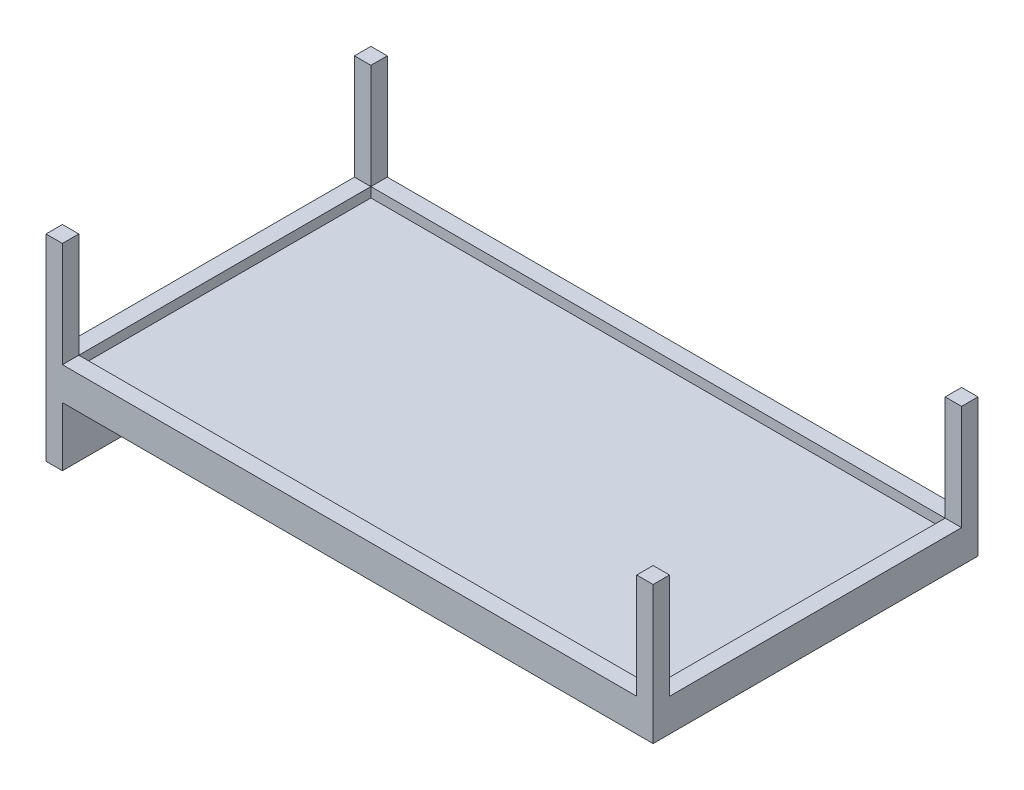
ISO-10303-21;
HEADER;
FILE_DESCRIPTION(('STEP AP214'),'2;1');
FILE_NAME('part.step','',(''),(''),'','','');
FILE_SCHEMA(('AUTOMOTIVE_DESIGN { 1 0 10303 214 1 1 1 1 }'));
ENDSEC;
DATA;
#1=APPLICATION_CONTEXT('core data for automotive mechanical design processes');
#2=APPLICATION_PROTOCOL_DEFINITION('international standard','automotive_design',2000,#1);
#3=PRODUCT_CONTEXT('',#1,'mechanical');
#4=PRODUCT('Part','Part','',(#3));
#5=PRODUCT_RELATED_PRODUCT_CATEGORY('part','',(#4));
#6=PRODUCT_DEFINITION_FORMATION('','',#4);
#7=PRODUCT_DEFINITION_CONTEXT('part definition',#1,'design');
#8=PRODUCT_DEFINITION('design','',#6,#7);
#9=PRODUCT_DEFINITION_SHAPE('','',#8);
#10=(LENGTH_UNIT() NAMED_UNIT(*) SI_UNIT(.MILLI.,.METRE.));
#11=(NAMED_UNIT(*) PLANE_ANGLE_UNIT() SI_UNIT($,.RADIAN.));
#12=(NAMED_UNIT(*) SI_UNIT($,.STERADIAN.) SOLID_ANGLE_UNIT());
#13=UNCERTAINTY_MEASURE_WITH_UNIT(LENGTH_MEASURE(1.E-05),#10,'distance_accuracy_value','');
#14=(GEOMETRIC_REPRESENTATION_CONTEXT(3) GLOBAL_UNCERTAINTY_ASSIGNED_CONTEXT((#13)) GLOBAL_UNIT_ASSIGNED_CONTEXT((#10,
#11,#12)) REPRESENTATION_CONTEXT('',''));
#15=CARTESIAN_POINT('',(0.,0.,0.));
#16=DIRECTION('',(0.,0.,1.));
#17=DIRECTION('',(1.,0.,0.));
#18=AXIS2_PLACEMENT_3D('',#15,#16,#17);
#19=CARTESIAN_POINT('',(0.,8.,0.));
#20=DIRECTION('',(0.,1.,0.));
#21=DIRECTION('',(0.,0.,1.));
#22=AXIS2_PLACEMENT_3D('',#19,#20,#21);
#23=PLANE('',#22);
#24=DIRECTION('',(1.,0.,0.));
#25=VECTOR('',#24,1.);
#26=CARTESIAN_POINT('',(0.,8.,39.0908590308371));
#27=LINE('',#26,#25);
#28=CARTESIAN_POINT('',(-77.8847688979616,8.,39.0908590308371));
#29=VERTEX_POINT('',#28);
#30=CARTESIAN_POINT('',(97.1152311020383,8.,39.0908590308371));
#31=VERTEX_POINT('',#30);
#32=EDGE_CURVE('E430',#29,#31,#27,.T.);
#33=ORIENTED_EDGE('',*,*,#32,.F.);
#34=DIRECTION('',(0.,0.,1.));
#35=VECTOR('',#34,1.);
#36=CARTESIAN_POINT('',(-77.8847688979616,8.,0.));
#37=LINE('',#36,#35);
#38=CARTESIAN_POINT('',(-77.8847688979616,8.,44.0908590308371));
#39=VERTEX_POINT('',#38);
#40=EDGE_CURVE('E249',#29,#39,#37,.T.);
#41=ORIENTED_EDGE('',*,*,#40,.T.);
#42=DIRECTION('',(1.,0.,0.));
#43=VECTOR('',#42,1.);
#44=CARTESIAN_POINT('',(0.,8.,44.0908590308371));
#45=LINE('',#44,#43);
#46=CARTESIAN_POINT('',(97.1152311020383,8.,44.0908590308371));
#47=VERTEX_POINT('',#46);
#48=EDGE_CURVE('E55',#39,#47,#45,.T.);
#49=ORIENTED_EDGE('',*,*,#48,.T.);
#50=DIRECTION('',(0.,0.,-1.));
#51=VECTOR('',#50,1.);
#52=CARTESIAN_POINT('',(97.1152311020383,8.,0.));
#53=LINE('',#52,#51);
#54=EDGE_CURVE('E280',#47,#31,#53,.T.);
#55=ORIENTED_EDGE('',*,*,#54,.T.);
#56=EDGE_LOOP('',(#33,#41,#49,#55));
#57=FACE_BOUND('',#56,.T.);
#58=ADVANCED_FACE('F39',(#57),#23,.T.);
#59=DIRECTION('',(0.,0.,1.));
#60=VECTOR('',#59,1.);
#61=CARTESIAN_POINT('',(-82.8847688979616,8.,0.));
#62=LINE('',#61,#60);
#63=CARTESIAN_POINT('',(-82.8847688979616,8.,-49.9091409691629));
#64=VERTEX_POINT('',#63);
#65=CARTESIAN_POINT('',(-82.8847688979616,8.,39.0908590308371));
#66=VERTEX_POINT('',#65);
#67=EDGE_CURVE('E406',#64,#66,#62,.T.);
#68=ORIENTED_EDGE('',*,*,#67,.T.);
#69=DIRECTION('',(1.,0.,0.));
#70=VECTOR('',#69,1.);
#71=CARTESIAN_POINT('',(0.,8.,39.0908590308371));
#72=LINE('',#71,#70);
#73=EDGE_CURVE('E245',#66,#29,#72,.T.);
#74=ORIENTED_EDGE('',*,*,#73,.T.);
#75=DIRECTION('',(0.,0.,1.));
#76=VECTOR('',#75,1.);
#77=CARTESIAN_POINT('',(-77.8847688979617,8.,0.));
#78=LINE('',#77,#76);
#79=CARTESIAN_POINT('',(-77.8847688979617,8.,-49.9091409691629));
#80=VERTEX_POINT('',#79);
#81=EDGE_CURVE('E434',#80,#29,#78,.T.);
#82=ORIENTED_EDGE('',*,*,#81,.F.);
#83=DIRECTION('',(-1.,0.,0.));
#84=VECTOR('',#83,1.);
#85=CARTESIAN_POINT('',(0.,8.,-49.9091409691629));
#86=LINE('',#85,#84);
#87=EDGE_CURVE('E11',#80,#64,#86,.T.);
#88=ORIENTED_EDGE('',*,*,#87,.T.);
#89=EDGE_LOOP('',(#68,#74,#82,#88));
#90=FACE_BOUND('',#89,.T.);
#91=ADVANCED_FACE('F500',(#90),#23,.T.);
#92=DIRECTION('',(0.,0.,1.));
#93=VECTOR('',#92,1.);
#94=CARTESIAN_POINT('',(97.1152311020383,8.,0.));
#95=LINE('',#94,#93);
#96=CARTESIAN_POINT('',(97.1152311020383,8.,-49.9091409691629));
#97=VERTEX_POINT('',#96);
#98=EDGE_CURVE('E442',#97,#31,#95,.T.);
#99=ORIENTED_EDGE('',*,*,#98,.T.);
#100=DIRECTION('',(1.,0.,0.));
#101=VECTOR('',#100,1.);
#102=CARTESIAN_POINT('',(0.,8.,39.0908590308371));
#103=LINE('',#102,#101);
#104=CARTESIAN_POINT('',(102.115231102038,8.,39.0908590308371));
#105=VERTEX_POINT('',#104);
#106=EDGE_CURVE('E63',#31,#105,#103,.T.);
#107=ORIENTED_EDGE('',*,*,#106,.T.);
#108=DIRECTION('',(0.,0.,1.));
#109=VECTOR('',#108,1.);
#110=CARTESIAN_POINT('',(102.115231102038,8.,0.));
#111=LINE('',#110,#109);
#112=CARTESIAN_POINT('',(102.115231102038,8.,-49.9091409691629));
#113=VERTEX_POINT('',#112);
#114=EDGE_CURVE('E423',#113,#105,#111,.T.);
#115=ORIENTED_EDGE('',*,*,#114,.F.);
#116=DIRECTION('',(-1.,0.,0.));
#117=VECTOR('',#116,1.);
#118=CARTESIAN_POINT('',(0.,8.,-49.9091409691629));
#119=LINE('',#118,#117);
#120=EDGE_CURVE('E308',#113,#97,#119,.T.);
#121=ORIENTED_EDGE('',*,*,#120,.T.);
#122=EDGE_LOOP('',(#99,#107,#115,#121));
#123=FACE_BOUND('',#122,.T.);
#124=ADVANCED_FACE('F513',(#123),#23,.T.);
#125=DIRECTION('',(1.,0.,0.));
#126=VECTOR('',#125,1.);
#127=CARTESIAN_POINT('',(0.,8.,-49.9091409691629));
#128=LINE('',#127,#126);
#129=EDGE_CURVE('E438',#80,#97,#128,.T.);
#130=ORIENTED_EDGE('',*,*,#129,.T.);
#131=DIRECTION('',(0.,0.,-1.));
#132=VECTOR('',#131,1.);
#133=CARTESIAN_POINT('',(97.1152311020383,8.,0.));
#134=LINE('',#133,#132);
#135=CARTESIAN_POINT('',(97.1152311020383,8.,-54.9091409691629));
#136=VERTEX_POINT('',#135);
#137=EDGE_CURVE('E312',#97,#136,#134,.T.);
#138=ORIENTED_EDGE('',*,*,#137,.T.);
#139=DIRECTION('',(1.,0.,0.));
#140=VECTOR('',#139,1.);
#141=CARTESIAN_POINT('',(0.,8.,-54.9091409691629));
#142=LINE('',#141,#140);
#143=CARTESIAN_POINT('',(-77.8847688979617,8.,-54.9091409691629));
#144=VERTEX_POINT('',#143);
#145=EDGE_CURVE('E426',#144,#136,#142,.T.);
#146=ORIENTED_EDGE('',*,*,#145,.F.);
#147=DIRECTION('',(0.,0.,1.));
#148=VECTOR('',#147,1.);
#149=CARTESIAN_POINT('',(-77.8847688979617,8.,0.));
#150=LINE('',#149,#148);
#151=EDGE_CURVE('E48',#144,#80,#150,.T.);
#152=ORIENTED_EDGE('',*,*,#151,.T.);
#153=EDGE_LOOP('',(#130,#138,#146,#152));
#154=FACE_BOUND('',#153,.T.);
#155=ADVANCED_FACE('F487',(#154),#23,.T.);
#156=CARTESIAN_POINT('',(-82.8847688979616,5.,-54.9091409691629));
#157=DIRECTION('',(1.,0.,0.));
#158=DIRECTION('',(0.,0.,-1.));
#159=AXIS2_PLACEMENT_3D('',#156,#157,#158);
#160=PLANE('',#159);
#161=DIRECTION('',(0.,-1.,0.));
#162=VECTOR('',#161,1.);
#163=CARTESIAN_POINT('',(-82.8847688979616,5.,44.0908590308371));
#164=LINE('',#163,#162);
#165=CARTESIAN_POINT('',(-82.8847688979616,40.,44.0908590308371));
#166=VERTEX_POINT('',#165);
#167=CARTESIAN_POINT('',(-82.8847688979616,-20.,44.0908590308371));
#168=VERTEX_POINT('',#167);
#169=EDGE_CURVE('E204',#166,#168,#164,.T.);
#170=ORIENTED_EDGE('',*,*,#169,.F.);
#171=DIRECTION('',(0.,0.,1.));
#172=VECTOR('',#171,1.);
#173=CARTESIAN_POINT('',(-82.8847688979616,40.,44.0908590308371));
#174=LINE('',#173,#172);
#175=CARTESIAN_POINT('',(-82.8847688979616,40.,39.0908590308371));
#176=VERTEX_POINT('',#175);
#177=EDGE_CURVE('E208',#176,#166,#174,.T.);
#178=ORIENTED_EDGE('',*,*,#177,.F.);
#179=DIRECTION('',(0.,-1.,0.));
#180=VECTOR('',#179,1.);
#181=CARTESIAN_POINT('',(-82.8847688979616,40.,39.0908590308371));
#182=LINE('',#181,#180);
#183=EDGE_CURVE('E237',#176,#66,#182,.T.);
#184=ORIENTED_EDGE('',*,*,#183,.T.);
#185=ORIENTED_EDGE('',*,*,#67,.F.);
#186=DIRECTION('',(0.,-1.,0.));
#187=VECTOR('',#186,1.);
#188=CARTESIAN_POINT('',(-82.8847688979616,40.,-49.9091409691629));
#189=LINE('',#188,#187);
#190=CARTESIAN_POINT('',(-82.8847688979616,40.,-49.9091409691629));
#191=VERTEX_POINT('',#190);
#192=EDGE_CURVE('E337',#191,#64,#189,.T.);
#193=ORIENTED_EDGE('',*,*,#192,.F.);
#194=DIRECTION('',(0.,0.,1.));
#195=VECTOR('',#194,1.);
#196=CARTESIAN_POINT('',(-82.8847688979616,40.,-54.9091409691629));
#197=LINE('',#196,#195);
#198=CARTESIAN_POINT('',(-82.8847688979616,40.,-54.9091409691629));
#199=VERTEX_POINT('',#198);
#200=EDGE_CURVE('E316',#199,#191,#197,.T.);
#201=ORIENTED_EDGE('',*,*,#200,.F.);
#202=DIRECTION('',(0.,-1.,0.));
#203=VECTOR('',#202,1.);
#204=CARTESIAN_POINT('',(-82.8847688979616,5.,-54.9091409691629));
#205=LINE('',#204,#203);
#206=CARTESIAN_POINT('',(-82.8847688979616,-20.,-54.9091409691629));
#207=VERTEX_POINT('',#206);
#208=EDGE_CURVE('E474',#199,#207,#205,.T.);
#209=ORIENTED_EDGE('',*,*,#208,.T.);
#210=DIRECTION('',(0.,0.,1.));
#211=VECTOR('',#210,1.);
#212=CARTESIAN_POINT('',(-82.8847688979616,-20.,-54.9091409691629));
#213=LINE('',#212,#211);
#214=EDGE_CURVE('E210',#207,#168,#213,.T.);
#215=ORIENTED_EDGE('',*,*,#214,.T.);
#216=EDGE_LOOP('',(#170,#178,#184,#185,#193,#201,#209,#215));
#217=FACE_BOUND('',#216,.T.);
#218=ADVANCED_FACE('F41',(#217),#160,.F.);
#219=CARTESIAN_POINT('',(-82.8847688979616,5.,44.0908590308371));
#220=DIRECTION('',(0.,0.,-1.));
#221=DIRECTION('',(-1.,0.,0.));
#222=AXIS2_PLACEMENT_3D('',#219,#220,#221);
#223=PLANE('',#222);
#224=ORIENTED_EDGE('',*,*,#48,.F.);
#225=DIRECTION('',(0.,-1.,0.));
#226=VECTOR('',#225,1.);
#227=CARTESIAN_POINT('',(-77.8847688979616,40.,44.0908590308371));
#228=LINE('',#227,#226);
#229=CARTESIAN_POINT('',(-77.8847688979616,40.,44.0908590308371));
#230=VERTEX_POINT('',#229);
#231=EDGE_CURVE('E220',#230,#39,#228,.T.);
#232=ORIENTED_EDGE('',*,*,#231,.F.);
#233=DIRECTION('',(1.,0.,0.));
#234=VECTOR('',#233,1.);
#235=CARTESIAN_POINT('',(-82.8847688979616,40.,44.0908590308371));
#236=LINE('',#235,#234);
#237=EDGE_CURVE('E218',#166,#230,#236,.T.);
#238=ORIENTED_EDGE('',*,*,#237,.F.);
#239=ORIENTED_EDGE('',*,*,#169,.T.);
#240=DIRECTION('',(1.,0.,0.));
#241=VECTOR('',#240,1.);
#242=CARTESIAN_POINT('',(-82.8847688979616,-20.,44.0908590308371));
#243=LINE('',#242,#241);
#244=CARTESIAN_POINT('',(-77.8847688979616,-20.,44.0908590308371));
#245=VERTEX_POINT('',#244);
#246=EDGE_CURVE('E342',#168,#245,#243,.T.);
#247=ORIENTED_EDGE('',*,*,#246,.T.);
#248=DIRECTION('',(0.,1.,0.));
#249=VECTOR('',#248,1.);
#250=CARTESIAN_POINT('',(-77.8847688979616,-20.,44.0908590308371));
#251=LINE('',#250,#249);
#252=CARTESIAN_POINT('',(-77.8847688979616,-2.,44.0908590308371));
#253=VERTEX_POINT('',#252);
#254=EDGE_CURVE('E353',#245,#253,#251,.T.);
#255=ORIENTED_EDGE('',*,*,#254,.T.);
#256=DIRECTION('',(1.,0.,0.));
#257=VECTOR('',#256,1.);
#258=CARTESIAN_POINT('',(0.,-2.,44.0908590308371));
#259=LINE('',#258,#257);
#260=CARTESIAN_POINT('',(102.115231102038,-2.,44.0908590308371));
#261=VERTEX_POINT('',#260);
#262=EDGE_CURVE('E380',#253,#261,#259,.T.);
#263=ORIENTED_EDGE('',*,*,#262,.T.);
#264=DIRECTION('',(0.,-1.,0.));
#265=VECTOR('',#264,1.);
#266=CARTESIAN_POINT('',(102.115231102038,5.,44.0908590308371));
#267=LINE('',#266,#265);
#268=CARTESIAN_POINT('',(102.115231102038,40.,44.0908590308371));
#269=VERTEX_POINT('',#268);
#270=EDGE_CURVE('E215',#269,#261,#267,.T.);
#271=ORIENTED_EDGE('',*,*,#270,.F.);
#272=DIRECTION('',(1.,0.,0.));
#273=VECTOR('',#272,1.);
#274=CARTESIAN_POINT('',(102.115231102038,40.,44.0908590308371));
#275=LINE('',#274,#273);
#276=CARTESIAN_POINT('',(97.1152311020383,40.,44.0908590308371));
#277=VERTEX_POINT('',#276);
#278=EDGE_CURVE('E262',#277,#269,#275,.T.);
#279=ORIENTED_EDGE('',*,*,#278,.F.);
#280=DIRECTION('',(0.,-1.,0.));
#281=VECTOR('',#280,1.);
#282=CARTESIAN_POINT('',(97.1152311020383,40.,44.0908590308371));
#283=LINE('',#282,#281);
#284=EDGE_CURVE('E266',#277,#47,#283,.T.);
#285=ORIENTED_EDGE('',*,*,#284,.T.);
#286=EDGE_LOOP('',(#224,#232,#238,#239,#247,#255,#263,#271,#279,#285));
#287=FACE_BOUND('',#286,.T.);
#288=ADVANCED_FACE('F219',(#287),#223,.F.);
#289=CARTESIAN_POINT('',(102.115231102038,5.,-54.9091409691629));
#290=DIRECTION('',(-1.,0.,0.));
#291=DIRECTION('',(0.,0.,1.));
#292=AXIS2_PLACEMENT_3D('',#289,#290,#291);
#293=PLANE('',#292);
#294=ORIENTED_EDGE('',*,*,#114,.T.);
#295=DIRECTION('',(0.,-1.,0.));
#296=VECTOR('',#295,1.);
#297=CARTESIAN_POINT('',(102.115231102038,40.,39.0908590308371));
#298=LINE('',#297,#296);
#299=CARTESIAN_POINT('',(102.115231102038,40.,39.0908590308371));
#300=VERTEX_POINT('',#299);
#301=EDGE_CURVE('E274',#300,#105,#298,.T.);
#302=ORIENTED_EDGE('',*,*,#301,.F.);
#303=DIRECTION('',(0.,0.,-1.));
#304=VECTOR('',#303,1.);
#305=CARTESIAN_POINT('',(102.115231102038,40.,44.0908590308371));
#306=LINE('',#305,#304);
#307=EDGE_CURVE('E252',#269,#300,#306,.T.);
#308=ORIENTED_EDGE('',*,*,#307,.F.);
#309=ORIENTED_EDGE('',*,*,#270,.T.);
#310=DIRECTION('',(0.,0.,1.));
#311=VECTOR('',#310,1.);
#312=CARTESIAN_POINT('',(102.115231102038,-2.,0.));
#313=LINE('',#312,#311);
#314=CARTESIAN_POINT('',(102.115231102038,-2.,-54.9091409691629));
#315=VERTEX_POINT('',#314);
#316=EDGE_CURVE('E384',#315,#261,#313,.T.);
#317=ORIENTED_EDGE('',*,*,#316,.F.);
#318=DIRECTION('',(0.,-1.,0.));
#319=VECTOR('',#318,1.);
#320=CARTESIAN_POINT('',(102.115231102038,5.,-54.9091409691629));
#321=LINE('',#320,#319);
#322=CARTESIAN_POINT('',(102.115231102038,40.,-54.9091409691629));
#323=VERTEX_POINT('',#322);
#324=EDGE_CURVE('E477',#323,#315,#321,.T.);
#325=ORIENTED_EDGE('',*,*,#324,.F.);
#326=DIRECTION('',(0.,0.,-1.));
#327=VECTOR('',#326,1.);
#328=CARTESIAN_POINT('',(102.115231102038,40.,-49.9091409691629));
#329=LINE('',#328,#327);
#330=CARTESIAN_POINT('',(102.115231102038,40.,-49.9091409691629));
#331=VERTEX_POINT('',#330);
#332=EDGE_CURVE('E290',#331,#323,#329,.T.);
#333=ORIENTED_EDGE('',*,*,#332,.F.);
#334=DIRECTION('',(0.,-1.,0.));
#335=VECTOR('',#334,1.);
#336=CARTESIAN_POINT('',(102.115231102038,40.,-49.9091409691629));
#337=LINE('',#336,#335);
#338=EDGE_CURVE('E300',#331,#113,#337,.T.);
#339=ORIENTED_EDGE('',*,*,#338,.T.);
#340=EDGE_LOOP('',(#294,#302,#308,#309,#317,#325,#333,#339));
#341=FACE_BOUND('',#340,.T.);
#342=ADVANCED_FACE('F658',(#341),#293,.F.);
#343=CARTESIAN_POINT('',(-82.8847688979616,5.,-54.9091409691629));
#344=DIRECTION('',(0.,0.,1.));
#345=DIRECTION('',(1.,0.,0.));
#346=AXIS2_PLACEMENT_3D('',#343,#344,#345);
#347=PLANE('',#346);
#348=ORIENTED_EDGE('',*,*,#145,.T.);
#349=DIRECTION('',(0.,-1.,0.));
#350=VECTOR('',#349,1.);
#351=CARTESIAN_POINT('',(97.1152311020383,40.,-54.9091409691629));
#352=LINE('',#351,#350);
#353=CARTESIAN_POINT('',(97.1152311020383,40.,-54.9091409691629));
#354=VERTEX_POINT('',#353);
#355=EDGE_CURVE('E297',#354,#136,#352,.T.);
#356=ORIENTED_EDGE('',*,*,#355,.F.);
#357=DIRECTION('',(-1.,0.,0.));
#358=VECTOR('',#357,1.);
#359=CARTESIAN_POINT('',(97.1152311020383,40.,-54.9091409691629));
#360=LINE('',#359,#358);
#361=EDGE_CURVE('E294',#323,#354,#360,.T.);
#362=ORIENTED_EDGE('',*,*,#361,.F.);
#363=ORIENTED_EDGE('',*,*,#324,.T.);
#364=DIRECTION('',(1.,0.,0.));
#365=VECTOR('',#364,1.);
#366=CARTESIAN_POINT('',(0.,-2.,-54.9091409691629));
#367=LINE('',#366,#365);
#368=CARTESIAN_POINT('',(-77.8847688979616,-2.,-54.9091409691629));
#369=VERTEX_POINT('',#368);
#370=EDGE_CURVE('E376',#369,#315,#367,.T.);
#371=ORIENTED_EDGE('',*,*,#370,.F.);
#372=DIRECTION('',(0.,1.,0.));
#373=VECTOR('',#372,1.);
#374=CARTESIAN_POINT('',(-77.8847688979616,-20.,-54.9091409691629));
#375=LINE('',#374,#373);
#376=CARTESIAN_POINT('',(-77.8847688979616,-20.,-54.9091409691629));
#377=VERTEX_POINT('',#376);
#378=EDGE_CURVE('E354',#377,#369,#375,.T.);
#379=ORIENTED_EDGE('',*,*,#378,.F.);
#380=DIRECTION('',(-1.,0.,0.));
#381=VECTOR('',#380,1.);
#382=CARTESIAN_POINT('',(-82.8847688979616,-20.,-54.9091409691629));
#383=LINE('',#382,#381);
#384=EDGE_CURVE('E349',#377,#207,#383,.T.);
#385=ORIENTED_EDGE('',*,*,#384,.T.);
#386=ORIENTED_EDGE('',*,*,#208,.F.);
#387=DIRECTION('',(-1.,0.,0.));
#388=VECTOR('',#387,1.);
#389=CARTESIAN_POINT('',(-82.8847688979616,40.,-54.9091409691629));
#390=LINE('',#389,#388);
#391=CARTESIAN_POINT('',(-77.8847688979617,40.,-54.9091409691629));
#392=VERTEX_POINT('',#391);
#393=EDGE_CURVE('E326',#392,#199,#390,.T.);
#394=ORIENTED_EDGE('',*,*,#393,.F.);
#395=DIRECTION('',(0.,-1.,0.));
#396=VECTOR('',#395,1.);
#397=CARTESIAN_POINT('',(-77.8847688979617,40.,-54.9091409691629));
#398=LINE('',#397,#396);
#399=EDGE_CURVE('E330',#392,#144,#398,.T.);
#400=ORIENTED_EDGE('',*,*,#399,.T.);
#401=EDGE_LOOP('',(#348,#356,#362,#363,#371,#379,#385,#386,#394,#400));
#402=FACE_BOUND('',#401,.T.);
#403=ADVANCED_FACE('F639',(#402),#347,.F.);
#404=CARTESIAN_POINT('',(0.,8.,39.0908590308371));
#405=DIRECTION('',(0.,0.,-1.));
#406=DIRECTION('',(-1.,0.,0.));
#407=AXIS2_PLACEMENT_3D('',#404,#405,#406);
#408=PLANE('',#407);
#409=DIRECTION('',(0.,-1.,0.));
#410=VECTOR('',#409,1.);
#411=CARTESIAN_POINT('',(97.1152311020383,8.,39.0908590308371));
#412=LINE('',#411,#410);
#413=CARTESIAN_POINT('',(97.1152311020383,5.,39.0908590308371));
#414=VERTEX_POINT('',#413);
#415=EDGE_CURVE('E445',#31,#414,#412,.T.);
#416=ORIENTED_EDGE('',*,*,#415,.T.);
#417=DIRECTION('',(-1.,0.,0.));
#418=VECTOR('',#417,1.);
#419=CARTESIAN_POINT('',(0.,5.,39.0908590308371));
#420=LINE('',#419,#418);
#421=CARTESIAN_POINT('',(-77.8847688979616,5.,39.0908590308371));
#422=VERTEX_POINT('',#421);
#423=EDGE_CURVE('E471',#414,#422,#420,.T.);
#424=ORIENTED_EDGE('',*,*,#423,.T.);
#425=DIRECTION('',(0.,-1.,0.));
#426=VECTOR('',#425,1.);
#427=CARTESIAN_POINT('',(-77.8847688979616,8.,39.0908590308371));
#428=LINE('',#427,#426);
#429=EDGE_CURVE('E456',#29,#422,#428,.T.);
#430=ORIENTED_EDGE('',*,*,#429,.F.);
#431=ORIENTED_EDGE('',*,*,#32,.T.);
#432=EDGE_LOOP('',(#416,#424,#430,#431));
#433=FACE_BOUND('',#432,.T.);
#434=ADVANCED_FACE('F506',(#433),#408,.T.);
#435=CARTESIAN_POINT('',(-77.8847688979617,8.,0.));
#436=DIRECTION('',(1.,0.,0.));
#437=DIRECTION('',(0.,0.,-1.));
#438=AXIS2_PLACEMENT_3D('',#435,#436,#437);
#439=PLANE('',#438);
#440=ORIENTED_EDGE('',*,*,#429,.T.);
#441=DIRECTION('',(0.,0.,-1.));
#442=VECTOR('',#441,1.);
#443=CARTESIAN_POINT('',(-77.8847688979617,5.,0.));
#444=LINE('',#443,#442);
#445=CARTESIAN_POINT('',(-77.8847688979617,5.,-49.9091409691629));
#446=VERTEX_POINT('',#445);
#447=EDGE_CURVE('E468',#422,#446,#444,.T.);
#448=ORIENTED_EDGE('',*,*,#447,.T.);
#449=DIRECTION('',(0.,-1.,0.));
#450=VECTOR('',#449,1.);
#451=CARTESIAN_POINT('',(-77.8847688979617,8.,-49.9091409691629));
#452=LINE('',#451,#450);
#453=EDGE_CURVE('E452',#80,#446,#452,.T.);
#454=ORIENTED_EDGE('',*,*,#453,.F.);
#455=ORIENTED_EDGE('',*,*,#81,.T.);
#456=EDGE_LOOP('',(#440,#448,#454,#455));
#457=FACE_BOUND('',#456,.T.);
#458=ADVANCED_FACE('F493',(#457),#439,.T.);
#459=CARTESIAN_POINT('',(0.,8.,-49.9091409691629));
#460=DIRECTION('',(0.,0.,-1.));
#461=DIRECTION('',(-1.,0.,0.));
#462=AXIS2_PLACEMENT_3D('',#459,#460,#461);
#463=PLANE('',#462);
#464=DIRECTION('',(-1.,0.,0.));
#465=VECTOR('',#464,1.);
#466=CARTESIAN_POINT('',(0.,5.,-49.9091409691629));
#467=LINE('',#466,#465);
#468=CARTESIAN_POINT('',(97.1152311020383,5.,-49.9091409691629));
#469=VERTEX_POINT('',#468);
#470=EDGE_CURVE('E464',#469,#446,#467,.T.);
#471=ORIENTED_EDGE('',*,*,#470,.F.);
#472=DIRECTION('',(0.,-1.,0.));
#473=VECTOR('',#472,1.);
#474=CARTESIAN_POINT('',(97.1152311020383,8.,-49.9091409691629));
#475=LINE('',#474,#473);
#476=EDGE_CURVE('E449',#97,#469,#475,.T.);
#477=ORIENTED_EDGE('',*,*,#476,.F.);
#478=ORIENTED_EDGE('',*,*,#129,.F.);
#479=ORIENTED_EDGE('',*,*,#453,.T.);
#480=EDGE_LOOP('',(#471,#477,#478,#479));
#481=FACE_BOUND('',#480,.T.);
#482=ADVANCED_FACE('F498',(#481),#463,.F.);
#483=CARTESIAN_POINT('',(97.1152311020383,8.,0.));
#484=DIRECTION('',(1.,0.,0.));
#485=DIRECTION('',(0.,0.,-1.));
#486=AXIS2_PLACEMENT_3D('',#483,#484,#485);
#487=PLANE('',#486);
#488=DIRECTION('',(0.,0.,-1.));
#489=VECTOR('',#488,1.);
#490=CARTESIAN_POINT('',(97.1152311020383,5.,0.));
#491=LINE('',#490,#489);
#492=EDGE_CURVE('E460',#414,#469,#491,.T.);
#493=ORIENTED_EDGE('',*,*,#492,.F.);
#494=ORIENTED_EDGE('',*,*,#415,.F.);
#495=ORIENTED_EDGE('',*,*,#98,.F.);
#496=ORIENTED_EDGE('',*,*,#476,.T.);
#497=EDGE_LOOP('',(#493,#494,#495,#496));
#498=FACE_BOUND('',#497,.T.);
#499=ADVANCED_FACE('F515',(#498),#487,.F.);
#500=CARTESIAN_POINT('',(0.,5.,0.));
#501=DIRECTION('',(0.,1.,0.));
#502=DIRECTION('',(0.,0.,1.));
#503=AXIS2_PLACEMENT_3D('',#500,#501,#502);
#504=PLANE('',#503);
#505=ORIENTED_EDGE('',*,*,#423,.F.);
#506=ORIENTED_EDGE('',*,*,#492,.T.);
#507=ORIENTED_EDGE('',*,*,#470,.T.);
#508=ORIENTED_EDGE('',*,*,#447,.F.);
#509=EDGE_LOOP('',(#505,#506,#507,#508));
#510=FACE_BOUND('',#509,.T.);
#511=ADVANCED_FACE('F517',(#510),#504,.T.);
#512=CARTESIAN_POINT('',(0.,-2.,39.0908590308371));
#513=DIRECTION('',(0.,0.,1.));
#514=DIRECTION('',(1.,0.,0.));
#515=AXIS2_PLACEMENT_3D('',#512,#513,#514);
#516=PLANE('',#515);
#517=DIRECTION('',(1.,0.,0.));
#518=VECTOR('',#517,1.);
#519=CARTESIAN_POINT('',(0.,0.,39.0908590308371));
#520=LINE('',#519,#518);
#521=CARTESIAN_POINT('',(-77.8847688979616,0.,39.0908590308371));
#522=VERTEX_POINT('',#521);
#523=CARTESIAN_POINT('',(97.1152311020383,0.,39.0908590308371));
#524=VERTEX_POINT('',#523);
#525=EDGE_CURVE('E389',#522,#524,#520,.T.);
#526=ORIENTED_EDGE('',*,*,#525,.T.);
#527=DIRECTION('',(0.,1.,0.));
#528=VECTOR('',#527,1.);
#529=CARTESIAN_POINT('',(97.1152311020383,-2.,39.0908590308371));
#530=LINE('',#529,#528);
#531=CARTESIAN_POINT('',(97.1152311020383,-2.,39.0908590308371));
#532=VERTEX_POINT('',#531);
#533=EDGE_CURVE('E402',#532,#524,#530,.T.);
#534=ORIENTED_EDGE('',*,*,#533,.F.);
#535=DIRECTION('',(1.,0.,0.));
#536=VECTOR('',#535,1.);
#537=CARTESIAN_POINT('',(0.,-2.,39.0908590308371));
#538=LINE('',#537,#536);
#539=CARTESIAN_POINT('',(-77.8847688979616,-2.,39.0908590308371));
#540=VERTEX_POINT('',#539);
#541=EDGE_CURVE('E364',#540,#532,#538,.T.);
#542=ORIENTED_EDGE('',*,*,#541,.F.);
#543=DIRECTION('',(0.,1.,0.));
#544=VECTOR('',#543,1.);
#545=CARTESIAN_POINT('',(-77.8847688979616,-2.,39.0908590308371));
#546=LINE('',#545,#544);
#547=EDGE_CURVE('E388',#540,#522,#546,.T.);
#548=ORIENTED_EDGE('',*,*,#547,.T.);
#549=EDGE_LOOP('',(#526,#534,#542,#548));
#550=FACE_BOUND('',#549,.T.);
#551=ADVANCED_FACE('F519',(#550),#516,.F.);
#552=CARTESIAN_POINT('',(97.1152311020383,-2.,0.));
#553=DIRECTION('',(-1.,0.,0.));
#554=DIRECTION('',(0.,0.,1.));
#555=AXIS2_PLACEMENT_3D('',#552,#553,#554);
#556=PLANE('',#555);
#557=DIRECTION('',(0.,0.,1.));
#558=VECTOR('',#557,1.);
#559=CARTESIAN_POINT('',(97.1152311020383,0.,0.));
#560=LINE('',#559,#558);
#561=CARTESIAN_POINT('',(97.1152311020383,0.,-49.9091409691629));
#562=VERTEX_POINT('',#561);
#563=EDGE_CURVE('E368',#562,#524,#560,.T.);
#564=ORIENTED_EDGE('',*,*,#563,.F.);
#565=DIRECTION('',(0.,1.,0.));
#566=VECTOR('',#565,1.);
#567=CARTESIAN_POINT('',(97.1152311020383,-2.,-49.9091409691629));
#568=LINE('',#567,#566);
#569=CARTESIAN_POINT('',(97.1152311020383,-2.,-49.9091409691629));
#570=VERTEX_POINT('',#569);
#571=EDGE_CURVE('E407',#570,#562,#568,.T.);
#572=ORIENTED_EDGE('',*,*,#571,.F.);
#573=DIRECTION('',(0.,0.,1.));
#574=VECTOR('',#573,1.);
#575=CARTESIAN_POINT('',(97.1152311020383,-2.,0.));
#576=LINE('',#575,#574);
#577=EDGE_CURVE('E372',#570,#532,#576,.T.);
#578=ORIENTED_EDGE('',*,*,#577,.T.);
#579=ORIENTED_EDGE('',*,*,#533,.T.);
#580=EDGE_LOOP('',(#564,#572,#578,#579));
#581=FACE_BOUND('',#580,.T.);
#582=ADVANCED_FACE('F525',(#581),#556,.T.);
#583=CARTESIAN_POINT('',(0.,-2.,-49.9091409691629));
#584=DIRECTION('',(0.,0.,1.));
#585=DIRECTION('',(1.,0.,0.));
#586=AXIS2_PLACEMENT_3D('',#583,#584,#585);
#587=PLANE('',#586);
#588=DIRECTION('',(1.,0.,0.));
#589=VECTOR('',#588,1.);
#590=CARTESIAN_POINT('',(0.,0.,-49.9091409691629));
#591=LINE('',#590,#589);
#592=CARTESIAN_POINT('',(-77.8847688979617,0.,-49.9091409691629));
#593=VERTEX_POINT('',#592);
#594=EDGE_CURVE('E397',#593,#562,#591,.T.);
#595=ORIENTED_EDGE('',*,*,#594,.F.);
#596=DIRECTION('',(0.,1.,0.));
#597=VECTOR('',#596,1.);
#598=CARTESIAN_POINT('',(-77.8847688979617,-2.,-49.9091409691629));
#599=LINE('',#598,#597);
#600=CARTESIAN_POINT('',(-77.8847688979616,-2.,-49.9091409691629));
#601=VERTEX_POINT('',#600);
#602=EDGE_CURVE('E411',#601,#593,#599,.T.);
#603=ORIENTED_EDGE('',*,*,#602,.F.);
#604=DIRECTION('',(1.,0.,0.));
#605=VECTOR('',#604,1.);
#606=CARTESIAN_POINT('',(0.,-2.,-49.9091409691629));
#607=LINE('',#606,#605);
#608=EDGE_CURVE('E367',#601,#570,#607,.T.);
#609=ORIENTED_EDGE('',*,*,#608,.T.);
#610=ORIENTED_EDGE('',*,*,#571,.T.);
#611=EDGE_LOOP('',(#595,#603,#609,#610));
#612=FACE_BOUND('',#611,.T.);
#613=ADVANCED_FACE('F591',(#612),#587,.T.);
#614=CARTESIAN_POINT('',(-77.8847688979617,-2.,0.));
#615=DIRECTION('',(-1.,0.,0.));
#616=DIRECTION('',(0.,0.,1.));
#617=AXIS2_PLACEMENT_3D('',#614,#615,#616);
#618=PLANE('',#617);
#619=DIRECTION('',(0.,0.,1.));
#620=VECTOR('',#619,1.);
#621=CARTESIAN_POINT('',(-77.8847688979617,0.,0.));
#622=LINE('',#621,#620);
#623=EDGE_CURVE('E393',#593,#522,#622,.T.);
#624=ORIENTED_EDGE('',*,*,#623,.T.);
#625=ORIENTED_EDGE('',*,*,#547,.F.);
#626=DIRECTION('',(0.,0.,-1.));
#627=VECTOR('',#626,1.);
#628=CARTESIAN_POINT('',(-77.8847688979616,-2.,0.));
#629=LINE('',#628,#627);
#630=EDGE_CURVE('E363',#253,#540,#629,.T.);
#631=ORIENTED_EDGE('',*,*,#630,.F.);
#632=ORIENTED_EDGE('',*,*,#254,.F.);
#633=DIRECTION('',(0.,0.,-1.));
#634=VECTOR('',#633,1.);
#635=CARTESIAN_POINT('',(-77.8847688979616,-20.,-54.9091409691629));
#636=LINE('',#635,#634);
#637=EDGE_CURVE('E345',#245,#377,#636,.T.);
#638=ORIENTED_EDGE('',*,*,#637,.T.);
#639=ORIENTED_EDGE('',*,*,#378,.T.);
#640=EDGE_CURVE('E357',#601,#369,#629,.T.);
#641=ORIENTED_EDGE('',*,*,#640,.F.);
#642=ORIENTED_EDGE('',*,*,#602,.T.);
#643=EDGE_LOOP('',(#624,#625,#631,#632,#638,#639,#641,#642));
#644=FACE_BOUND('',#643,.T.);
#645=ADVANCED_FACE('F580',(#644),#618,.F.);
#646=CARTESIAN_POINT('',(0.,-2.,0.));
#647=DIRECTION('',(0.,1.,0.));
#648=DIRECTION('',(0.,0.,1.));
#649=AXIS2_PLACEMENT_3D('',#646,#647,#648);
#650=PLANE('',#649);
#651=ORIENTED_EDGE('',*,*,#262,.F.);
#652=ORIENTED_EDGE('',*,*,#630,.T.);
#653=ORIENTED_EDGE('',*,*,#541,.T.);
#654=ORIENTED_EDGE('',*,*,#577,.F.);
#655=ORIENTED_EDGE('',*,*,#608,.F.);
#656=ORIENTED_EDGE('',*,*,#640,.T.);
#657=ORIENTED_EDGE('',*,*,#370,.T.);
#658=ORIENTED_EDGE('',*,*,#316,.T.);
#659=EDGE_LOOP('',(#651,#652,#653,#654,#655,#656,#657,#658));
#660=FACE_BOUND('',#659,.T.);
#661=ADVANCED_FACE('F575',(#660),#650,.F.);
#662=CARTESIAN_POINT('',(0.,0.,0.));
#663=DIRECTION('',(0.,1.,0.));
#664=DIRECTION('',(0.,0.,1.));
#665=AXIS2_PLACEMENT_3D('',#662,#663,#664);
#666=PLANE('',#665);
#667=ORIENTED_EDGE('',*,*,#525,.F.);
#668=ORIENTED_EDGE('',*,*,#623,.F.);
#669=ORIENTED_EDGE('',*,*,#594,.T.);
#670=ORIENTED_EDGE('',*,*,#563,.T.);
#671=EDGE_LOOP('',(#667,#668,#669,#670));
#672=FACE_BOUND('',#671,.T.);
#673=ADVANCED_FACE('F565',(#672),#666,.F.);
#674=CARTESIAN_POINT('',(0.,-20.,0.));
#675=DIRECTION('',(0.,1.,0.));
#676=DIRECTION('',(0.,0.,1.));
#677=AXIS2_PLACEMENT_3D('',#674,#675,#676);
#678=PLANE('',#677);
#679=ORIENTED_EDGE('',*,*,#214,.F.);
#680=ORIENTED_EDGE('',*,*,#384,.F.);
#681=ORIENTED_EDGE('',*,*,#637,.F.);
#682=ORIENTED_EDGE('',*,*,#246,.F.);
#683=EDGE_LOOP('',(#679,#680,#681,#682));
#684=FACE_BOUND('',#683,.T.);
#685=ADVANCED_FACE('F559',(#684),#678,.F.);
#686=CARTESIAN_POINT('',(-82.8847688979616,40.,-49.9091409691629));
#687=DIRECTION('',(0.,0.,-1.));
#688=DIRECTION('',(-1.,0.,0.));
#689=AXIS2_PLACEMENT_3D('',#686,#687,#688);
#690=PLANE('',#689);
#691=ORIENTED_EDGE('',*,*,#87,.F.);
#692=DIRECTION('',(0.,-1.,0.));
#693=VECTOR('',#692,1.);
#694=CARTESIAN_POINT('',(-77.8847688979617,40.,-49.9091409691629));
#695=LINE('',#694,#693);
#696=CARTESIAN_POINT('',(-77.8847688979617,40.,-49.9091409691629));
#697=VERTEX_POINT('',#696);
#698=EDGE_CURVE('E333',#697,#80,#695,.T.);
#699=ORIENTED_EDGE('',*,*,#698,.F.);
#700=DIRECTION('',(1.,0.,0.));
#701=VECTOR('',#700,1.);
#702=CARTESIAN_POINT('',(-82.8847688979616,40.,-49.9091409691629));
#703=LINE('',#702,#701);
#704=EDGE_CURVE('E320',#191,#697,#703,.T.);
#705=ORIENTED_EDGE('',*,*,#704,.F.);
#706=ORIENTED_EDGE('',*,*,#192,.T.);
#707=EDGE_LOOP('',(#691,#699,#705,#706));
#708=FACE_BOUND('',#707,.T.);
#709=ADVANCED_FACE('F564',(#708),#690,.F.);
#710=CARTESIAN_POINT('',(-77.8847688979617,40.,-54.9091409691629));
#711=DIRECTION('',(-1.,0.,0.));
#712=DIRECTION('',(0.,0.,1.));
#713=AXIS2_PLACEMENT_3D('',#710,#711,#712);
#714=PLANE('',#713);
#715=ORIENTED_EDGE('',*,*,#151,.F.);
#716=ORIENTED_EDGE('',*,*,#399,.F.);
#717=DIRECTION('',(0.,0.,-1.));
#718=VECTOR('',#717,1.);
#719=CARTESIAN_POINT('',(-77.8847688979617,40.,-54.9091409691629));
#720=LINE('',#719,#718);
#721=EDGE_CURVE('E323',#697,#392,#720,.T.);
#722=ORIENTED_EDGE('',*,*,#721,.F.);
#723=ORIENTED_EDGE('',*,*,#698,.T.);
#724=EDGE_LOOP('',(#715,#716,#722,#723));
#725=FACE_BOUND('',#724,.T.);
#726=ADVANCED_FACE('F719',(#725),#714,.F.);
#727=CARTESIAN_POINT('',(0.,40.,0.));
#728=DIRECTION('',(0.,1.,0.));
#729=DIRECTION('',(0.,0.,1.));
#730=AXIS2_PLACEMENT_3D('',#727,#728,#729);
#731=PLANE('',#730);
#732=ORIENTED_EDGE('',*,*,#200,.T.);
#733=ORIENTED_EDGE('',*,*,#704,.T.);
#734=ORIENTED_EDGE('',*,*,#721,.T.);
#735=ORIENTED_EDGE('',*,*,#393,.T.);
#736=EDGE_LOOP('',(#732,#733,#734,#735));
#737=FACE_BOUND('',#736,.T.);
#738=ADVANCED_FACE('F730',(#737),#731,.T.);
#739=CARTESIAN_POINT('',(97.1152311020383,40.,-49.9091409691629));
#740=DIRECTION('',(1.,0.,0.));
#741=DIRECTION('',(0.,0.,-1.));
#742=AXIS2_PLACEMENT_3D('',#739,#740,#741);
#743=PLANE('',#742);
#744=ORIENTED_EDGE('',*,*,#137,.F.);
#745=DIRECTION('',(0.,-1.,0.));
#746=VECTOR('',#745,1.);
#747=CARTESIAN_POINT('',(97.1152311020383,40.,-49.9091409691629));
#748=LINE('',#747,#746);
#749=CARTESIAN_POINT('',(97.1152311020383,40.,-49.9091409691629));
#750=VERTEX_POINT('',#749);
#751=EDGE_CURVE('E304',#750,#97,#748,.T.);
#752=ORIENTED_EDGE('',*,*,#751,.F.);
#753=DIRECTION('',(0.,0.,1.));
#754=VECTOR('',#753,1.);
#755=CARTESIAN_POINT('',(97.1152311020383,40.,-49.9091409691629));
#756=LINE('',#755,#754);
#757=EDGE_CURVE('E283',#354,#750,#756,.T.);
#758=ORIENTED_EDGE('',*,*,#757,.F.);
#759=ORIENTED_EDGE('',*,*,#355,.T.);
#760=EDGE_LOOP('',(#744,#752,#758,#759));
#761=FACE_BOUND('',#760,.T.);
#762=ADVANCED_FACE('F739',(#761),#743,.F.);
#763=CARTESIAN_POINT('',(97.1152311020383,40.,-49.9091409691629));
#764=DIRECTION('',(0.,0.,-1.));
#765=DIRECTION('',(-1.,0.,0.));
#766=AXIS2_PLACEMENT_3D('',#763,#764,#765);
#767=PLANE('',#766);
#768=ORIENTED_EDGE('',*,*,#120,.F.);
#769=ORIENTED_EDGE('',*,*,#338,.F.);
#770=DIRECTION('',(1.,0.,0.));
#771=VECTOR('',#770,1.);
#772=CARTESIAN_POINT('',(97.1152311020383,40.,-49.9091409691629));
#773=LINE('',#772,#771);
#774=EDGE_CURVE('E287',#750,#331,#773,.T.);
#775=ORIENTED_EDGE('',*,*,#774,.F.);
#776=ORIENTED_EDGE('',*,*,#751,.T.);
#777=EDGE_LOOP('',(#768,#769,#775,#776));
#778=FACE_BOUND('',#777,.T.);
#779=ADVANCED_FACE('F749',(#778),#767,.F.);
#780=CARTESIAN_POINT('',(0.,40.,0.));
#781=DIRECTION('',(0.,-1.,0.));
#782=DIRECTION('',(0.,0.,-1.));
#783=AXIS2_PLACEMENT_3D('',#780,#781,#782);
#784=PLANE('',#783);
#785=ORIENTED_EDGE('',*,*,#757,.T.);
#786=ORIENTED_EDGE('',*,*,#774,.T.);
#787=ORIENTED_EDGE('',*,*,#332,.T.);
#788=ORIENTED_EDGE('',*,*,#361,.T.);
#789=EDGE_LOOP('',(#785,#786,#787,#788));
#790=FACE_BOUND('',#789,.T.);
#791=ADVANCED_FACE('F759',(#790),#784,.F.);
#792=CARTESIAN_POINT('',(102.115231102038,40.,39.0908590308371));
#793=DIRECTION('',(0.,0.,1.));
#794=DIRECTION('',(1.,0.,0.));
#795=AXIS2_PLACEMENT_3D('',#792,#793,#794);
#796=PLANE('',#795);
#797=ORIENTED_EDGE('',*,*,#106,.F.);
#798=DIRECTION('',(0.,-1.,0.));
#799=VECTOR('',#798,1.);
#800=CARTESIAN_POINT('',(97.1152311020383,40.,39.0908590308371));
#801=LINE('',#800,#799);
#802=CARTESIAN_POINT('',(97.1152311020383,40.,39.0908590308371));
#803=VERTEX_POINT('',#802);
#804=EDGE_CURVE('E270',#803,#31,#801,.T.);
#805=ORIENTED_EDGE('',*,*,#804,.F.);
#806=DIRECTION('',(-1.,0.,0.));
#807=VECTOR('',#806,1.);
#808=CARTESIAN_POINT('',(102.115231102038,40.,39.0908590308371));
#809=LINE('',#808,#807);
#810=EDGE_CURVE('E256',#300,#803,#809,.T.);
#811=ORIENTED_EDGE('',*,*,#810,.F.);
#812=ORIENTED_EDGE('',*,*,#301,.T.);
#813=EDGE_LOOP('',(#797,#805,#811,#812));
#814=FACE_BOUND('',#813,.T.);
#815=ADVANCED_FACE('F769',(#814),#796,.F.);
#816=CARTESIAN_POINT('',(97.1152311020383,40.,44.0908590308371));
#817=DIRECTION('',(1.,0.,0.));
#818=DIRECTION('',(0.,0.,-1.));
#819=AXIS2_PLACEMENT_3D('',#816,#817,#818);
#820=PLANE('',#819);
#821=ORIENTED_EDGE('',*,*,#54,.F.);
#822=ORIENTED_EDGE('',*,*,#284,.F.);
#823=DIRECTION('',(0.,0.,1.));
#824=VECTOR('',#823,1.);
#825=CARTESIAN_POINT('',(97.1152311020383,40.,44.0908590308371));
#826=LINE('',#825,#824);
#827=EDGE_CURVE('E259',#803,#277,#826,.T.);
#828=ORIENTED_EDGE('',*,*,#827,.F.);
#829=ORIENTED_EDGE('',*,*,#804,.T.);
#830=EDGE_LOOP('',(#821,#822,#828,#829));
#831=FACE_BOUND('',#830,.T.);
#832=ADVANCED_FACE('F779',(#831),#820,.F.);
#833=CARTESIAN_POINT('',(0.,40.,0.));
#834=DIRECTION('',(0.,1.,0.));
#835=DIRECTION('',(0.,0.,1.));
#836=AXIS2_PLACEMENT_3D('',#833,#834,#835);
#837=PLANE('',#836);
#838=ORIENTED_EDGE('',*,*,#307,.T.);
#839=ORIENTED_EDGE('',*,*,#810,.T.);
#840=ORIENTED_EDGE('',*,*,#827,.T.);
#841=ORIENTED_EDGE('',*,*,#278,.T.);
#842=EDGE_LOOP('',(#838,#839,#840,#841));
#843=FACE_BOUND('',#842,.T.);
#844=ADVANCED_FACE('F789',(#843),#837,.T.);
#845=CARTESIAN_POINT('',(-77.8847688979616,40.,44.0908590308371));
#846=DIRECTION('',(-1.,0.,0.));
#847=DIRECTION('',(0.,0.,1.));
#848=AXIS2_PLACEMENT_3D('',#845,#846,#847);
#849=PLANE('',#848);
#850=ORIENTED_EDGE('',*,*,#40,.F.);
#851=DIRECTION('',(0.,-1.,0.));
#852=VECTOR('',#851,1.);
#853=CARTESIAN_POINT('',(-77.8847688979616,40.,39.0908590308371));
#854=LINE('',#853,#852);
#855=CARTESIAN_POINT('',(-77.8847688979616,40.,39.0908590308371));
#856=VERTEX_POINT('',#855);
#857=EDGE_CURVE('E240',#856,#29,#854,.T.);
#858=ORIENTED_EDGE('',*,*,#857,.F.);
#859=DIRECTION('',(0.,0.,-1.));
#860=VECTOR('',#859,1.);
#861=CARTESIAN_POINT('',(-77.8847688979616,40.,44.0908590308371));
#862=LINE('',#861,#860);
#863=EDGE_CURVE('E224',#230,#856,#862,.T.);
#864=ORIENTED_EDGE('',*,*,#863,.F.);
#865=ORIENTED_EDGE('',*,*,#231,.T.);
#866=EDGE_LOOP('',(#850,#858,#864,#865));
#867=FACE_BOUND('',#866,.T.);
#868=ADVANCED_FACE('F798',(#867),#849,.F.);
#869=CARTESIAN_POINT('',(-82.8847688979616,40.,39.0908590308371));
#870=DIRECTION('',(0.,0.,1.));
#871=DIRECTION('',(1.,0.,0.));
#872=AXIS2_PLACEMENT_3D('',#869,#870,#871);
#873=PLANE('',#872);
#874=ORIENTED_EDGE('',*,*,#73,.F.);
#875=ORIENTED_EDGE('',*,*,#183,.F.);
#876=DIRECTION('',(-1.,0.,0.));
#877=VECTOR('',#876,1.);
#878=CARTESIAN_POINT('',(-82.8847688979616,40.,39.0908590308371));
#879=LINE('',#878,#877);
#880=EDGE_CURVE('E228',#856,#176,#879,.T.);
#881=ORIENTED_EDGE('',*,*,#880,.F.);
#882=ORIENTED_EDGE('',*,*,#857,.T.);
#883=EDGE_LOOP('',(#874,#875,#881,#882));
#884=FACE_BOUND('',#883,.T.);
#885=ADVANCED_FACE('F808',(#884),#873,.F.);
#886=CARTESIAN_POINT('',(0.,40.,0.));
#887=DIRECTION('',(0.,-1.,0.));
#888=DIRECTION('',(0.,0.,-1.));
#889=AXIS2_PLACEMENT_3D('',#886,#887,#888);
#890=PLANE('',#889);
#891=ORIENTED_EDGE('',*,*,#177,.T.);
#892=ORIENTED_EDGE('',*,*,#237,.T.);
#893=ORIENTED_EDGE('',*,*,#863,.T.);
#894=ORIENTED_EDGE('',*,*,#880,.T.);
#895=EDGE_LOOP('',(#891,#892,#893,#894));
#896=FACE_BOUND('',#895,.T.);
#897=ADVANCED_FACE('F226',(#896),#890,.F.);
#898=CLOSED_SHELL('',(#58,#91,#124,#155,#218,#288,#342,#403,#434,#458,#482,#499,#511,#551,#582,
#613,#645,#661,#673,#685,#709,#726,#738,#762,#779,#791,#815,#832,#844,#868,#885,#897));
#899=MANIFOLD_SOLID_BREP('B2',#898);
#900=ADVANCED_BREP_SHAPE_REPRESENTATION('',(#18,#899),#14);
#901=SHAPE_DEFINITION_REPRESENTATION(#9,#900);
ENDSEC;
END-ISO-10303-21;
